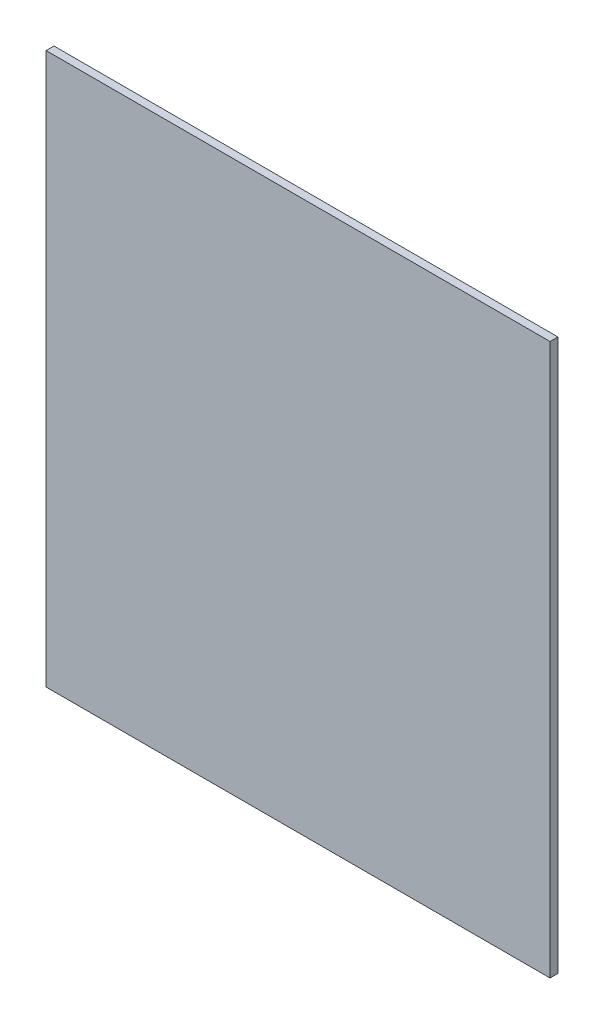
ISO-10303-21;
HEADER;
FILE_DESCRIPTION(('STEP AP214'),'2;1');
FILE_NAME('part.step','',(''),(''),'','','');
FILE_SCHEMA(('AUTOMOTIVE_DESIGN { 1 0 10303 214 1 1 1 1 }'));
ENDSEC;
DATA;
#1=APPLICATION_CONTEXT('core data for automotive mechanical design processes');
#2=APPLICATION_PROTOCOL_DEFINITION('international standard','automotive_design',2000,#1);
#3=PRODUCT_CONTEXT('',#1,'mechanical');
#4=PRODUCT('Part','Part','',(#3));
#5=PRODUCT_RELATED_PRODUCT_CATEGORY('part','',(#4));
#6=PRODUCT_DEFINITION_FORMATION('','',#4);
#7=PRODUCT_DEFINITION_CONTEXT('part definition',#1,'design');
#8=PRODUCT_DEFINITION('design','',#6,#7);
#9=PRODUCT_DEFINITION_SHAPE('','',#8);
#10=(LENGTH_UNIT() NAMED_UNIT(*) SI_UNIT(.MILLI.,.METRE.));
#11=(NAMED_UNIT(*) PLANE_ANGLE_UNIT() SI_UNIT($,.RADIAN.));
#12=(NAMED_UNIT(*) SI_UNIT($,.STERADIAN.) SOLID_ANGLE_UNIT());
#13=UNCERTAINTY_MEASURE_WITH_UNIT(LENGTH_MEASURE(1.E-05),#10,'distance_accuracy_value','');
#14=(GEOMETRIC_REPRESENTATION_CONTEXT(3) GLOBAL_UNCERTAINTY_ASSIGNED_CONTEXT((#13)) GLOBAL_UNIT_ASSIGNED_CONTEXT((#10,
#11,#12)) REPRESENTATION_CONTEXT('',''));
#15=CARTESIAN_POINT('',(0.,0.,0.));
#16=DIRECTION('',(0.,0.,1.));
#17=DIRECTION('',(1.,0.,0.));
#18=AXIS2_PLACEMENT_3D('',#15,#16,#17);
#19=CARTESIAN_POINT('',(160.,175.,-5.));
#20=DIRECTION('',(1.,0.,0.));
#21=DIRECTION('',(0.,1.,0.));
#22=AXIS2_PLACEMENT_3D('',#19,#20,#21);
#23=PLANE('',#22);
#24=DIRECTION('',(0.,1.,0.));
#25=VECTOR('',#24,1.);
#26=CARTESIAN_POINT('',(160.,175.,0.));
#27=LINE('',#26,#25);
#28=CARTESIAN_POINT('',(160.,-175.,0.));
#29=VERTEX_POINT('',#28);
#30=CARTESIAN_POINT('',(160.,175.,0.));
#31=VERTEX_POINT('',#30);
#32=EDGE_CURVE('E103',#29,#31,#27,.T.);
#33=ORIENTED_EDGE('',*,*,#32,.F.);
#34=DIRECTION('',(0.,0.,1.));
#35=VECTOR('',#34,1.);
#36=CARTESIAN_POINT('',(160.,-175.,-5.));
#37=LINE('',#36,#35);
#38=CARTESIAN_POINT('',(160.,-175.,-5.));
#39=VERTEX_POINT('',#38);
#40=EDGE_CURVE('E11',#39,#29,#37,.T.);
#41=ORIENTED_EDGE('',*,*,#40,.F.);
#42=DIRECTION('',(0.,1.,0.));
#43=VECTOR('',#42,1.);
#44=CARTESIAN_POINT('',(160.,175.,-5.));
#45=LINE('',#44,#43);
#46=CARTESIAN_POINT('',(160.,175.,-5.));
#47=VERTEX_POINT('',#46);
#48=EDGE_CURVE('E97',#39,#47,#45,.T.);
#49=ORIENTED_EDGE('',*,*,#48,.T.);
#50=DIRECTION('',(0.,0.,1.));
#51=VECTOR('',#50,1.);
#52=CARTESIAN_POINT('',(160.,175.,-5.));
#53=LINE('',#52,#51);
#54=EDGE_CURVE('E42',#47,#31,#53,.T.);
#55=ORIENTED_EDGE('',*,*,#54,.T.);
#56=EDGE_LOOP('',(#33,#41,#49,#55));
#57=FACE_BOUND('',#56,.T.);
#58=ADVANCED_FACE('F39',(#57),#23,.T.);
#59=CARTESIAN_POINT('',(-160.,-175.,-5.));
#60=DIRECTION('',(0.,-1.,0.));
#61=DIRECTION('',(0.,0.,-1.));
#62=AXIS2_PLACEMENT_3D('',#59,#60,#61);
#63=PLANE('',#62);
#64=DIRECTION('',(1.,0.,0.));
#65=VECTOR('',#64,1.);
#66=CARTESIAN_POINT('',(-160.,-175.,0.));
#67=LINE('',#66,#65);
#68=CARTESIAN_POINT('',(-160.,-175.,0.));
#69=VERTEX_POINT('',#68);
#70=EDGE_CURVE('E99',#69,#29,#67,.T.);
#71=ORIENTED_EDGE('',*,*,#70,.F.);
#72=DIRECTION('',(0.,0.,1.));
#73=VECTOR('',#72,1.);
#74=CARTESIAN_POINT('',(-160.,-175.,-5.));
#75=LINE('',#74,#73);
#76=CARTESIAN_POINT('',(-160.,-175.,-5.));
#77=VERTEX_POINT('',#76);
#78=EDGE_CURVE('E48',#77,#69,#75,.T.);
#79=ORIENTED_EDGE('',*,*,#78,.F.);
#80=DIRECTION('',(1.,0.,0.));
#81=VECTOR('',#80,1.);
#82=CARTESIAN_POINT('',(-160.,-175.,-5.));
#83=LINE('',#82,#81);
#84=EDGE_CURVE('E94',#77,#39,#83,.T.);
#85=ORIENTED_EDGE('',*,*,#84,.T.);
#86=ORIENTED_EDGE('',*,*,#40,.T.);
#87=EDGE_LOOP('',(#71,#79,#85,#86));
#88=FACE_BOUND('',#87,.T.);
#89=ADVANCED_FACE('F113',(#88),#63,.T.);
#90=CARTESIAN_POINT('',(-160.,175.,-5.));
#91=DIRECTION('',(-1.,0.,0.));
#92=DIRECTION('',(0.,0.,1.));
#93=AXIS2_PLACEMENT_3D('',#90,#91,#92);
#94=PLANE('',#93);
#95=DIRECTION('',(0.,-1.,0.));
#96=VECTOR('',#95,1.);
#97=CARTESIAN_POINT('',(-160.,175.,0.));
#98=LINE('',#97,#96);
#99=CARTESIAN_POINT('',(-160.,175.,0.));
#100=VERTEX_POINT('',#99);
#101=EDGE_CURVE('E89',#100,#69,#98,.T.);
#102=ORIENTED_EDGE('',*,*,#101,.F.);
#103=DIRECTION('',(0.,0.,1.));
#104=VECTOR('',#103,1.);
#105=CARTESIAN_POINT('',(-160.,175.,-5.));
#106=LINE('',#105,#104);
#107=CARTESIAN_POINT('',(-160.,175.,-5.));
#108=VERTEX_POINT('',#107);
#109=EDGE_CURVE('E84',#108,#100,#106,.T.);
#110=ORIENTED_EDGE('',*,*,#109,.F.);
#111=DIRECTION('',(0.,-1.,0.));
#112=VECTOR('',#111,1.);
#113=CARTESIAN_POINT('',(-160.,175.,-5.));
#114=LINE('',#113,#112);
#115=EDGE_CURVE('E87',#108,#77,#114,.T.);
#116=ORIENTED_EDGE('',*,*,#115,.T.);
#117=ORIENTED_EDGE('',*,*,#78,.T.);
#118=EDGE_LOOP('',(#102,#110,#116,#117));
#119=FACE_BOUND('',#118,.T.);
#120=ADVANCED_FACE('F86',(#119),#94,.T.);
#121=CARTESIAN_POINT('',(-160.,175.,-5.));
#122=DIRECTION('',(0.,1.,0.));
#123=DIRECTION('',(0.,0.,1.));
#124=AXIS2_PLACEMENT_3D('',#121,#122,#123);
#125=PLANE('',#124);
#126=DIRECTION('',(-1.,0.,0.));
#127=VECTOR('',#126,1.);
#128=CARTESIAN_POINT('',(-160.,175.,0.));
#129=LINE('',#128,#127);
#130=EDGE_CURVE('E106',#31,#100,#129,.T.);
#131=ORIENTED_EDGE('',*,*,#130,.F.);
#132=ORIENTED_EDGE('',*,*,#54,.F.);
#133=DIRECTION('',(-1.,0.,0.));
#134=VECTOR('',#133,1.);
#135=CARTESIAN_POINT('',(-160.,175.,-5.));
#136=LINE('',#135,#134);
#137=EDGE_CURVE('E93',#47,#108,#136,.T.);
#138=ORIENTED_EDGE('',*,*,#137,.T.);
#139=ORIENTED_EDGE('',*,*,#109,.T.);
#140=EDGE_LOOP('',(#131,#132,#138,#139));
#141=FACE_BOUND('',#140,.T.);
#142=ADVANCED_FACE('F96',(#141),#125,.T.);
#143=CARTESIAN_POINT('',(0.,0.,-5.));
#144=DIRECTION('',(0.,0.,1.));
#145=DIRECTION('',(1.,0.,0.));
#146=AXIS2_PLACEMENT_3D('',#143,#144,#145);
#147=PLANE('',#146);
#148=ORIENTED_EDGE('',*,*,#48,.F.);
#149=ORIENTED_EDGE('',*,*,#84,.F.);
#150=ORIENTED_EDGE('',*,*,#115,.F.);
#151=ORIENTED_EDGE('',*,*,#137,.F.);
#152=EDGE_LOOP('',(#148,#149,#150,#151));
#153=FACE_BOUND('',#152,.T.);
#154=ADVANCED_FACE('F92',(#153),#147,.F.);
#155=CARTESIAN_POINT('',(0.,0.,0.));
#156=DIRECTION('',(0.,0.,1.));
#157=DIRECTION('',(1.,0.,0.));
#158=AXIS2_PLACEMENT_3D('',#155,#156,#157);
#159=PLANE('',#158);
#160=ORIENTED_EDGE('',*,*,#32,.T.);
#161=ORIENTED_EDGE('',*,*,#130,.T.);
#162=ORIENTED_EDGE('',*,*,#101,.T.);
#163=ORIENTED_EDGE('',*,*,#70,.T.);
#164=EDGE_LOOP('',(#160,#161,#162,#163));
#165=FACE_BOUND('',#164,.T.);
#166=ADVANCED_FACE('F112',(#165),#159,.T.);
#167=CLOSED_SHELL('',(#58,#89,#120,#142,#154,#166));
#168=MANIFOLD_SOLID_BREP('B2',#167);
#169=ADVANCED_BREP_SHAPE_REPRESENTATION('',(#18,#168),#14);
#170=SHAPE_DEFINITION_REPRESENTATION(#9,#169);
ENDSEC;
END-ISO-10303-21;
